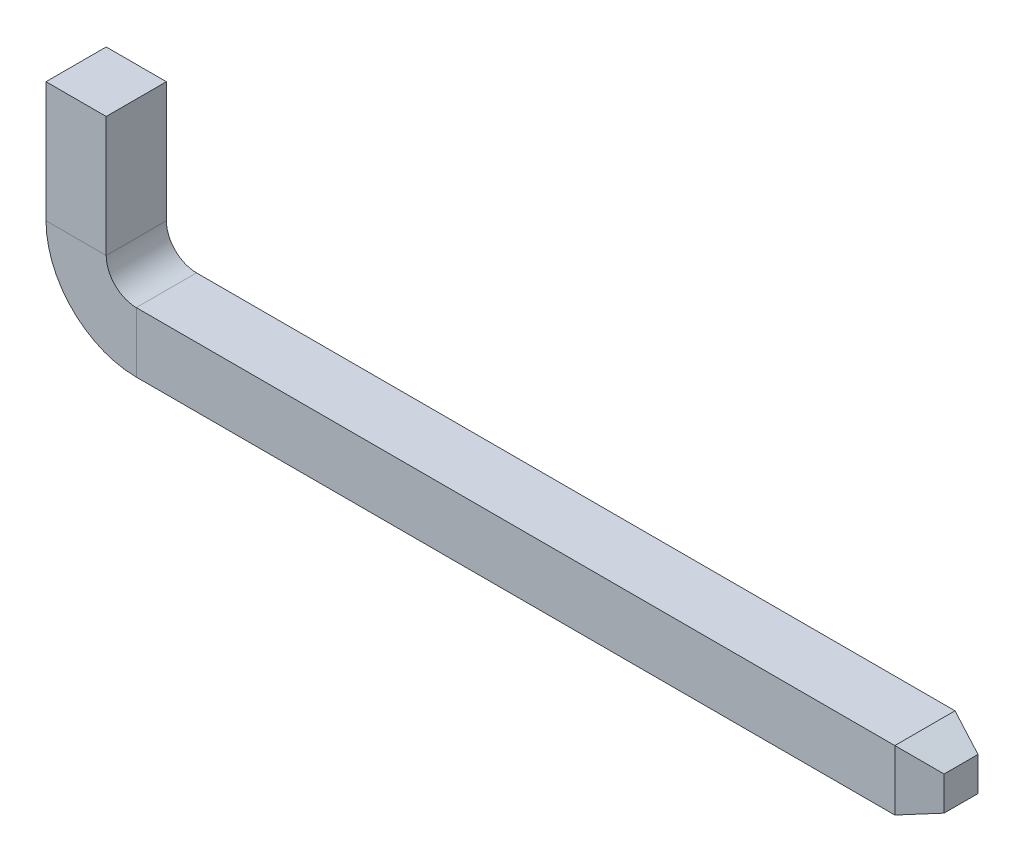
ISO-10303-21;
HEADER;
FILE_DESCRIPTION(('STEP AP214'),'2;1');
FILE_NAME('part.step','',(''),(''),'','','');
FILE_SCHEMA(('AUTOMOTIVE_DESIGN { 1 0 10303 214 1 1 1 1 }'));
ENDSEC;
DATA;
#1=APPLICATION_CONTEXT('core data for automotive mechanical design processes');
#2=APPLICATION_PROTOCOL_DEFINITION('international standard','automotive_design',2000,#1);
#3=PRODUCT_CONTEXT('',#1,'mechanical');
#4=PRODUCT('Part','Part','',(#3));
#5=PRODUCT_RELATED_PRODUCT_CATEGORY('part','',(#4));
#6=PRODUCT_DEFINITION_FORMATION('','',#4);
#7=PRODUCT_DEFINITION_CONTEXT('part definition',#1,'design');
#8=PRODUCT_DEFINITION('design','',#6,#7);
#9=PRODUCT_DEFINITION_SHAPE('','',#8);
#10=(LENGTH_UNIT() NAMED_UNIT(*) SI_UNIT(.MILLI.,.METRE.));
#11=(NAMED_UNIT(*) PLANE_ANGLE_UNIT() SI_UNIT($,.RADIAN.));
#12=(NAMED_UNIT(*) SI_UNIT($,.STERADIAN.) SOLID_ANGLE_UNIT());
#13=UNCERTAINTY_MEASURE_WITH_UNIT(LENGTH_MEASURE(1.E-05),#10,'distance_accuracy_value','');
#14=(GEOMETRIC_REPRESENTATION_CONTEXT(3) GLOBAL_UNCERTAINTY_ASSIGNED_CONTEXT((#13)) GLOBAL_UNIT_ASSIGNED_CONTEXT((#10,
#11,#12)) REPRESENTATION_CONTEXT('',''));
#15=CARTESIAN_POINT('',(0.,0.,0.));
#16=DIRECTION('',(0.,0.,1.));
#17=DIRECTION('',(1.,0.,0.));
#18=AXIS2_PLACEMENT_3D('',#15,#16,#17);
#19=CARTESIAN_POINT('',(0.,0.,0.));
#20=DIRECTION('',(0.,-1.,0.));
#21=DIRECTION('',(0.,0.,-1.));
#22=AXIS2_PLACEMENT_3D('',#19,#20,#21);
#23=PLANE('',#22);
#24=DIRECTION('',(0.,0.,-1.));
#25=VECTOR('',#24,1.);
#26=CARTESIAN_POINT('',(0.25,0.,0.25));
#27=LINE('',#26,#25);
#28=CARTESIAN_POINT('',(0.25,0.,0.25));
#29=VERTEX_POINT('',#28);
#30=CARTESIAN_POINT('',(0.25,0.,-0.25));
#31=VERTEX_POINT('',#30);
#32=EDGE_CURVE('E123',#29,#31,#27,.T.);
#33=ORIENTED_EDGE('',*,*,#32,.T.);
#34=DIRECTION('',(-1.,0.,0.));
#35=VECTOR('',#34,1.);
#36=CARTESIAN_POINT('',(-0.25,0.,-0.25));
#37=LINE('',#36,#35);
#38=CARTESIAN_POINT('',(-0.25,0.,-0.25));
#39=VERTEX_POINT('',#38);
#40=EDGE_CURVE('E151',#31,#39,#37,.T.);
#41=ORIENTED_EDGE('',*,*,#40,.T.);
#42=DIRECTION('',(0.,0.,1.));
#43=VECTOR('',#42,1.);
#44=CARTESIAN_POINT('',(-0.25,0.,0.25));
#45=LINE('',#44,#43);
#46=CARTESIAN_POINT('',(-0.25,0.,0.25));
#47=VERTEX_POINT('',#46);
#48=EDGE_CURVE('E154',#39,#47,#45,.T.);
#49=ORIENTED_EDGE('',*,*,#48,.T.);
#50=DIRECTION('',(1.,0.,0.));
#51=VECTOR('',#50,1.);
#52=CARTESIAN_POINT('',(-0.25,0.,0.25));
#53=LINE('',#52,#51);
#54=EDGE_CURVE('E171',#47,#29,#53,.T.);
#55=ORIENTED_EDGE('',*,*,#54,.T.);
#56=EDGE_LOOP('',(#33,#41,#49,#55));
#57=FACE_BOUND('',#56,.T.);
#58=ADVANCED_FACE('F32',(#57),#23,.F.);
#59=CARTESIAN_POINT('',(0.25,0.,0.25));
#60=DIRECTION('',(-1.,0.,0.));
#61=DIRECTION('',(0.,-1.,0.));
#62=AXIS2_PLACEMENT_3D('',#59,#60,#61);
#63=PLANE('',#62);
#64=DIRECTION('',(0.,-1.,0.));
#65=VECTOR('',#64,1.);
#66=CARTESIAN_POINT('',(0.25,0.,-0.25));
#67=LINE('',#66,#65);
#68=CARTESIAN_POINT('',(0.25,-1.,-0.25));
#69=VERTEX_POINT('',#68);
#70=EDGE_CURVE('E159',#31,#69,#67,.T.);
#71=ORIENTED_EDGE('',*,*,#70,.F.);
#72=ORIENTED_EDGE('',*,*,#32,.F.);
#73=DIRECTION('',(0.,-1.,0.));
#74=VECTOR('',#73,1.);
#75=CARTESIAN_POINT('',(0.25,0.,0.25));
#76=LINE('',#75,#74);
#77=CARTESIAN_POINT('',(0.25,-1.,0.25));
#78=VERTEX_POINT('',#77);
#79=EDGE_CURVE('E186',#29,#78,#76,.T.);
#80=ORIENTED_EDGE('',*,*,#79,.T.);
#81=DIRECTION('',(0.,0.,-1.));
#82=VECTOR('',#81,1.);
#83=CARTESIAN_POINT('',(0.25,-1.,0.25));
#84=LINE('',#83,#82);
#85=EDGE_CURVE('E202',#78,#69,#84,.T.);
#86=ORIENTED_EDGE('',*,*,#85,.T.);
#87=EDGE_LOOP('',(#71,#72,#80,#86));
#88=FACE_BOUND('',#87,.T.);
#89=ADVANCED_FACE('F271',(#88),#63,.F.);
#90=CARTESIAN_POINT('',(-0.25,0.,-0.25));
#91=DIRECTION('',(0.,0.,1.));
#92=DIRECTION('',(1.,0.,0.));
#93=AXIS2_PLACEMENT_3D('',#90,#91,#92);
#94=PLANE('',#93);
#95=DIRECTION('',(0.,-1.,0.));
#96=VECTOR('',#95,1.);
#97=CARTESIAN_POINT('',(-0.25,0.,-0.25));
#98=LINE('',#97,#96);
#99=CARTESIAN_POINT('',(-0.25,-1.,-0.25));
#100=VERTEX_POINT('',#99);
#101=EDGE_CURVE('E158',#39,#100,#98,.T.);
#102=ORIENTED_EDGE('',*,*,#101,.F.);
#103=ORIENTED_EDGE('',*,*,#40,.F.);
#104=ORIENTED_EDGE('',*,*,#70,.T.);
#105=DIRECTION('',(-1.,0.,0.));
#106=VECTOR('',#105,1.);
#107=CARTESIAN_POINT('',(-0.25,-1.,-0.25));
#108=LINE('',#107,#106);
#109=EDGE_CURVE('E155',#69,#100,#108,.T.);
#110=ORIENTED_EDGE('',*,*,#109,.T.);
#111=EDGE_LOOP('',(#102,#103,#104,#110));
#112=FACE_BOUND('',#111,.T.);
#113=ADVANCED_FACE('F263',(#112),#94,.F.);
#114=CARTESIAN_POINT('',(-0.25,0.,0.25));
#115=DIRECTION('',(1.,0.,0.));
#116=DIRECTION('',(0.,1.,0.));
#117=AXIS2_PLACEMENT_3D('',#114,#115,#116);
#118=PLANE('',#117);
#119=DIRECTION('',(0.,-1.,0.));
#120=VECTOR('',#119,1.);
#121=CARTESIAN_POINT('',(-0.25,0.,0.25));
#122=LINE('',#121,#120);
#123=CARTESIAN_POINT('',(-0.25,-1.,0.25));
#124=VERTEX_POINT('',#123);
#125=EDGE_CURVE('E174',#47,#124,#122,.T.);
#126=ORIENTED_EDGE('',*,*,#125,.F.);
#127=ORIENTED_EDGE('',*,*,#48,.F.);
#128=ORIENTED_EDGE('',*,*,#101,.T.);
#129=DIRECTION('',(0.,0.,1.));
#130=VECTOR('',#129,1.);
#131=CARTESIAN_POINT('',(-0.25,-1.,0.25));
#132=LINE('',#131,#130);
#133=EDGE_CURVE('E162',#100,#124,#132,.T.);
#134=ORIENTED_EDGE('',*,*,#133,.T.);
#135=EDGE_LOOP('',(#126,#127,#128,#134));
#136=FACE_BOUND('',#135,.T.);
#137=ADVANCED_FACE('F255',(#136),#118,.F.);
#138=CARTESIAN_POINT('',(-0.25,0.,0.25));
#139=DIRECTION('',(0.,0.,-1.));
#140=DIRECTION('',(-1.,0.,0.));
#141=AXIS2_PLACEMENT_3D('',#138,#139,#140);
#142=PLANE('',#141);
#143=DIRECTION('',(1.,0.,0.));
#144=VECTOR('',#143,1.);
#145=CARTESIAN_POINT('',(-0.25,-1.,0.25));
#146=LINE('',#145,#144);
#147=EDGE_CURVE('E177',#124,#78,#146,.T.);
#148=ORIENTED_EDGE('',*,*,#147,.T.);
#149=ORIENTED_EDGE('',*,*,#79,.F.);
#150=ORIENTED_EDGE('',*,*,#54,.F.);
#151=ORIENTED_EDGE('',*,*,#125,.T.);
#152=EDGE_LOOP('',(#148,#149,#150,#151));
#153=FACE_BOUND('',#152,.T.);
#154=ADVANCED_FACE('F253',(#153),#142,.F.);
#155=CARTESIAN_POINT('',(0.5,-1.,0.));
#156=DIRECTION('',(0.,0.,1.));
#157=DIRECTION('',(1.,0.,0.));
#158=AXIS2_PLACEMENT_3D('',#155,#156,#157);
#159=CYLINDRICAL_SURFACE('',#158,0.25);
#160=CARTESIAN_POINT('',(0.5,-1.,-0.25));
#161=DIRECTION('',(0.,0.,1.));
#162=DIRECTION('',(-1.,0.,0.));
#163=AXIS2_PLACEMENT_3D('',#160,#161,#162);
#164=CIRCLE('',#163,0.25);
#165=CARTESIAN_POINT('',(0.5,-1.25,-0.25));
#166=VERTEX_POINT('',#165);
#167=EDGE_CURVE('E164',#69,#166,#164,.T.);
#168=ORIENTED_EDGE('',*,*,#167,.F.);
#169=ORIENTED_EDGE('',*,*,#85,.F.);
#170=CARTESIAN_POINT('',(0.5,-1.,0.25));
#171=DIRECTION('',(0.,0.,1.));
#172=DIRECTION('',(-1.,0.,0.));
#173=AXIS2_PLACEMENT_3D('',#170,#171,#172);
#174=CIRCLE('',#173,0.25);
#175=CARTESIAN_POINT('',(0.5,-1.25,0.25));
#176=VERTEX_POINT('',#175);
#177=EDGE_CURVE('E188',#78,#176,#174,.T.);
#178=ORIENTED_EDGE('',*,*,#177,.T.);
#179=DIRECTION('',(0.,0.,-1.));
#180=VECTOR('',#179,1.);
#181=CARTESIAN_POINT('',(0.5,-1.25,0.25));
#182=LINE('',#181,#180);
#183=EDGE_CURVE('E196',#176,#166,#182,.T.);
#184=ORIENTED_EDGE('',*,*,#183,.T.);
#185=EDGE_LOOP('',(#168,#169,#178,#184));
#186=FACE_BOUND('',#185,.T.);
#187=ADVANCED_FACE('F200',(#186),#159,.F.);
#188=CARTESIAN_POINT('',(-0.25,-1.,-0.25));
#189=DIRECTION('',(0.,0.,1.));
#190=DIRECTION('',(1.,0.,0.));
#191=AXIS2_PLACEMENT_3D('',#188,#189,#190);
#192=PLANE('',#191);
#193=CARTESIAN_POINT('',(0.5,-1.,-0.25));
#194=DIRECTION('',(0.,0.,1.));
#195=DIRECTION('',(-1.,0.,0.));
#196=AXIS2_PLACEMENT_3D('',#193,#194,#195);
#197=CIRCLE('',#196,0.75);
#198=CARTESIAN_POINT('',(0.5,-1.75,-0.25));
#199=VERTEX_POINT('',#198);
#200=EDGE_CURVE('E77',#100,#199,#197,.T.);
#201=ORIENTED_EDGE('',*,*,#200,.F.);
#202=ORIENTED_EDGE('',*,*,#109,.F.);
#203=ORIENTED_EDGE('',*,*,#167,.T.);
#204=DIRECTION('',(0.,-1.,0.));
#205=VECTOR('',#204,1.);
#206=CARTESIAN_POINT('',(0.5,-1.75,-0.25));
#207=LINE('',#206,#205);
#208=EDGE_CURVE('E144',#166,#199,#207,.T.);
#209=ORIENTED_EDGE('',*,*,#208,.T.);
#210=EDGE_LOOP('',(#201,#202,#203,#209));
#211=FACE_BOUND('',#210,.T.);
#212=ADVANCED_FACE('F260',(#211),#192,.F.);
#213=CARTESIAN_POINT('',(0.5,-1.,0.));
#214=DIRECTION('',(0.,0.,1.));
#215=DIRECTION('',(1.,0.,0.));
#216=AXIS2_PLACEMENT_3D('',#213,#214,#215);
#217=CYLINDRICAL_SURFACE('',#216,0.75);
#218=CARTESIAN_POINT('',(0.5,-1.,0.25));
#219=DIRECTION('',(0.,0.,1.));
#220=DIRECTION('',(-1.,0.,0.));
#221=AXIS2_PLACEMENT_3D('',#218,#219,#220);
#222=CIRCLE('',#221,0.75);
#223=CARTESIAN_POINT('',(0.5,-1.75,0.25));
#224=VERTEX_POINT('',#223);
#225=EDGE_CURVE('E66',#124,#224,#222,.T.);
#226=ORIENTED_EDGE('',*,*,#225,.F.);
#227=ORIENTED_EDGE('',*,*,#133,.F.);
#228=ORIENTED_EDGE('',*,*,#200,.T.);
#229=DIRECTION('',(0.,0.,1.));
#230=VECTOR('',#229,1.);
#231=CARTESIAN_POINT('',(0.5,-1.75,0.25));
#232=LINE('',#231,#230);
#233=EDGE_CURVE('E165',#199,#224,#232,.T.);
#234=ORIENTED_EDGE('',*,*,#233,.T.);
#235=EDGE_LOOP('',(#226,#227,#228,#234));
#236=FACE_BOUND('',#235,.T.);
#237=ADVANCED_FACE('F252',(#236),#217,.T.);
#238=CARTESIAN_POINT('',(-0.25,-1.,0.25));
#239=DIRECTION('',(0.,0.,-1.));
#240=DIRECTION('',(-1.,0.,0.));
#241=AXIS2_PLACEMENT_3D('',#238,#239,#240);
#242=PLANE('',#241);
#243=DIRECTION('',(0.,1.,0.));
#244=VECTOR('',#243,1.);
#245=CARTESIAN_POINT('',(0.5,-1.75,0.25));
#246=LINE('',#245,#244);
#247=EDGE_CURVE('E150',#224,#176,#246,.T.);
#248=ORIENTED_EDGE('',*,*,#247,.T.);
#249=ORIENTED_EDGE('',*,*,#177,.F.);
#250=ORIENTED_EDGE('',*,*,#147,.F.);
#251=ORIENTED_EDGE('',*,*,#225,.T.);
#252=EDGE_LOOP('',(#248,#249,#250,#251));
#253=FACE_BOUND('',#252,.T.);
#254=ADVANCED_FACE('F192',(#253),#242,.F.);
#255=CARTESIAN_POINT('',(0.5,-1.25,0.25));
#256=DIRECTION('',(0.,-1.,0.));
#257=DIRECTION('',(0.,0.,-1.));
#258=AXIS2_PLACEMENT_3D('',#255,#256,#257);
#259=PLANE('',#258);
#260=DIRECTION('',(1.,0.,0.));
#261=VECTOR('',#260,1.);
#262=CARTESIAN_POINT('',(0.5,-1.25,-0.25));
#263=LINE('',#262,#261);
#264=CARTESIAN_POINT('',(6.8,-1.25,-0.25));
#265=VERTEX_POINT('',#264);
#266=EDGE_CURVE('E134',#166,#265,#263,.T.);
#267=ORIENTED_EDGE('',*,*,#266,.F.);
#268=ORIENTED_EDGE('',*,*,#183,.F.);
#269=DIRECTION('',(1.,0.,0.));
#270=VECTOR('',#269,1.);
#271=CARTESIAN_POINT('',(0.5,-1.25,0.25));
#272=LINE('',#271,#270);
#273=CARTESIAN_POINT('',(6.8,-1.25,0.25));
#274=VERTEX_POINT('',#273);
#275=EDGE_CURVE('E141',#176,#274,#272,.T.);
#276=ORIENTED_EDGE('',*,*,#275,.T.);
#277=DIRECTION('',(0.,0.,-1.));
#278=VECTOR('',#277,1.);
#279=CARTESIAN_POINT('',(6.8,-1.25,0.25));
#280=LINE('',#279,#278);
#281=EDGE_CURVE('E119',#274,#265,#280,.T.);
#282=ORIENTED_EDGE('',*,*,#281,.T.);
#283=EDGE_LOOP('',(#267,#268,#276,#282));
#284=FACE_BOUND('',#283,.T.);
#285=ADVANCED_FACE('F138',(#284),#259,.F.);
#286=CARTESIAN_POINT('',(0.5,-1.75,-0.25));
#287=DIRECTION('',(0.,0.,1.));
#288=DIRECTION('',(1.,0.,0.));
#289=AXIS2_PLACEMENT_3D('',#286,#287,#288);
#290=PLANE('',#289);
#291=DIRECTION('',(1.,0.,0.));
#292=VECTOR('',#291,1.);
#293=CARTESIAN_POINT('',(0.5,-1.75,-0.25));
#294=LINE('',#293,#292);
#295=CARTESIAN_POINT('',(6.8,-1.75,-0.25));
#296=VERTEX_POINT('',#295);
#297=EDGE_CURVE('E133',#199,#296,#294,.T.);
#298=ORIENTED_EDGE('',*,*,#297,.F.);
#299=ORIENTED_EDGE('',*,*,#208,.F.);
#300=ORIENTED_EDGE('',*,*,#266,.T.);
#301=DIRECTION('',(0.,-1.,0.));
#302=VECTOR('',#301,1.);
#303=CARTESIAN_POINT('',(6.8,-1.75,-0.25));
#304=LINE('',#303,#302);
#305=EDGE_CURVE('E127',#265,#296,#304,.T.);
#306=ORIENTED_EDGE('',*,*,#305,.T.);
#307=EDGE_LOOP('',(#298,#299,#300,#306));
#308=FACE_BOUND('',#307,.T.);
#309=ADVANCED_FACE('F143',(#308),#290,.F.);
#310=CARTESIAN_POINT('',(0.5,-1.75,0.25));
#311=DIRECTION('',(0.,1.,0.));
#312=DIRECTION('',(0.,0.,1.));
#313=AXIS2_PLACEMENT_3D('',#310,#311,#312);
#314=PLANE('',#313);
#315=DIRECTION('',(1.,0.,0.));
#316=VECTOR('',#315,1.);
#317=CARTESIAN_POINT('',(0.5,-1.75,0.25));
#318=LINE('',#317,#316);
#319=CARTESIAN_POINT('',(6.8,-1.75,0.25));
#320=VERTEX_POINT('',#319);
#321=EDGE_CURVE('E40',#224,#320,#318,.T.);
#322=ORIENTED_EDGE('',*,*,#321,.F.);
#323=ORIENTED_EDGE('',*,*,#233,.F.);
#324=ORIENTED_EDGE('',*,*,#297,.T.);
#325=DIRECTION('',(0.,0.,1.));
#326=VECTOR('',#325,1.);
#327=CARTESIAN_POINT('',(6.8,-1.75,0.25));
#328=LINE('',#327,#326);
#329=EDGE_CURVE('E168',#296,#320,#328,.T.);
#330=ORIENTED_EDGE('',*,*,#329,.T.);
#331=EDGE_LOOP('',(#322,#323,#324,#330));
#332=FACE_BOUND('',#331,.T.);
#333=ADVANCED_FACE('F230',(#332),#314,.F.);
#334=CARTESIAN_POINT('',(0.5,-1.75,0.25));
#335=DIRECTION('',(0.,0.,-1.));
#336=DIRECTION('',(-1.,0.,0.));
#337=AXIS2_PLACEMENT_3D('',#334,#335,#336);
#338=PLANE('',#337);
#339=DIRECTION('',(0.,1.,0.));
#340=VECTOR('',#339,1.);
#341=CARTESIAN_POINT('',(6.8,-1.75,0.25));
#342=LINE('',#341,#340);
#343=EDGE_CURVE('E11',#320,#274,#342,.T.);
#344=ORIENTED_EDGE('',*,*,#343,.T.);
#345=ORIENTED_EDGE('',*,*,#275,.F.);
#346=ORIENTED_EDGE('',*,*,#247,.F.);
#347=ORIENTED_EDGE('',*,*,#321,.T.);
#348=EDGE_LOOP('',(#344,#345,#346,#347));
#349=FACE_BOUND('',#348,.T.);
#350=ADVANCED_FACE('F232',(#349),#338,.F.);
#351=CARTESIAN_POINT('',(6.8,-1.75,-0.25));
#352=DIRECTION('',(0.342020143325669,0.,-0.939692620785908));
#353=DIRECTION('',(-0.939692620785908,0.,-0.342020143325669));
#354=AXIS2_PLACEMENT_3D('',#351,#352,#353);
#355=PLANE('',#354);
#356=ORIENTED_EDGE('',*,*,#305,.F.);
#357=DIRECTION('',(-0.889126490715988,0.323615577118185,-0.323615577118185));
#358=VECTOR('',#357,1.);
#359=CARTESIAN_POINT('',(6.8,-1.25,-0.25));
#360=LINE('',#359,#358);
#361=CARTESIAN_POINT('',(7.1,-1.35919107027986,-0.140808929720139));
#362=VERTEX_POINT('',#361);
#363=EDGE_CURVE('E115',#362,#265,#360,.T.);
#364=ORIENTED_EDGE('',*,*,#363,.F.);
#365=DIRECTION('',(0.,-1.,0.));
#366=VECTOR('',#365,1.);
#367=CARTESIAN_POINT('',(7.1,-1.75,-0.140808929720139));
#368=LINE('',#367,#366);
#369=CARTESIAN_POINT('',(7.1,-1.64080892972014,-0.140808929720139));
#370=VERTEX_POINT('',#369);
#371=EDGE_CURVE('E217',#370,#362,#368,.F.);
#372=ORIENTED_EDGE('',*,*,#371,.F.);
#373=DIRECTION('',(-0.889126490715988,-0.323615577118185,-0.323615577118185));
#374=VECTOR('',#373,1.);
#375=CARTESIAN_POINT('',(6.8,-1.75,-0.25));
#376=LINE('',#375,#374);
#377=EDGE_CURVE('E47',#370,#296,#376,.T.);
#378=ORIENTED_EDGE('',*,*,#377,.T.);
#379=EDGE_LOOP('',(#356,#364,#372,#378));
#380=FACE_BOUND('',#379,.T.);
#381=ADVANCED_FACE('F128',(#380),#355,.T.);
#382=CARTESIAN_POINT('',(6.8,-1.25,-0.25));
#383=DIRECTION('',(0.342020143325669,0.939692620785908,0.));
#384=DIRECTION('',(-0.939692620785908,0.342020143325669,0.));
#385=AXIS2_PLACEMENT_3D('',#382,#383,#384);
#386=PLANE('',#385);
#387=ORIENTED_EDGE('',*,*,#281,.F.);
#388=DIRECTION('',(-0.889126490715988,0.323615577118185,0.323615577118185));
#389=VECTOR('',#388,1.);
#390=CARTESIAN_POINT('',(6.8,-1.25,0.25));
#391=LINE('',#390,#389);
#392=CARTESIAN_POINT('',(7.1,-1.35919107027986,0.140808929720139));
#393=VERTEX_POINT('',#392);
#394=EDGE_CURVE('E124',#393,#274,#391,.T.);
#395=ORIENTED_EDGE('',*,*,#394,.F.);
#396=DIRECTION('',(0.,0.,-1.));
#397=VECTOR('',#396,1.);
#398=CARTESIAN_POINT('',(7.1,-1.35919107027986,-0.25));
#399=LINE('',#398,#397);
#400=EDGE_CURVE('E121',#362,#393,#399,.F.);
#401=ORIENTED_EDGE('',*,*,#400,.F.);
#402=ORIENTED_EDGE('',*,*,#363,.T.);
#403=EDGE_LOOP('',(#387,#395,#401,#402));
#404=FACE_BOUND('',#403,.T.);
#405=ADVANCED_FACE('F116',(#404),#386,.T.);
#406=CARTESIAN_POINT('',(6.8,-1.25,0.25));
#407=DIRECTION('',(0.342020143325669,0.,0.939692620785908));
#408=DIRECTION('',(0.939692620785908,0.,-0.342020143325669));
#409=AXIS2_PLACEMENT_3D('',#406,#407,#408);
#410=PLANE('',#409);
#411=ORIENTED_EDGE('',*,*,#343,.F.);
#412=DIRECTION('',(-0.889126490715988,-0.323615577118185,0.323615577118185));
#413=VECTOR('',#412,1.);
#414=CARTESIAN_POINT('',(6.8,-1.75,0.25));
#415=LINE('',#414,#413);
#416=CARTESIAN_POINT('',(7.1,-1.64080892972014,0.140808929720139));
#417=VERTEX_POINT('',#416);
#418=EDGE_CURVE('E220',#417,#320,#415,.T.);
#419=ORIENTED_EDGE('',*,*,#418,.F.);
#420=DIRECTION('',(0.,1.,0.));
#421=VECTOR('',#420,1.);
#422=CARTESIAN_POINT('',(7.1,-1.25,0.140808929720139));
#423=LINE('',#422,#421);
#424=EDGE_CURVE('E214',#393,#417,#423,.F.);
#425=ORIENTED_EDGE('',*,*,#424,.F.);
#426=ORIENTED_EDGE('',*,*,#394,.T.);
#427=EDGE_LOOP('',(#411,#419,#425,#426));
#428=FACE_BOUND('',#427,.T.);
#429=ADVANCED_FACE('F233',(#428),#410,.T.);
#430=CARTESIAN_POINT('',(6.8,-1.75,0.25));
#431=DIRECTION('',(0.342020143325669,-0.939692620785908,0.));
#432=DIRECTION('',(0.939692620785908,0.342020143325669,0.));
#433=AXIS2_PLACEMENT_3D('',#430,#431,#432);
#434=PLANE('',#433);
#435=ORIENTED_EDGE('',*,*,#329,.F.);
#436=ORIENTED_EDGE('',*,*,#377,.F.);
#437=DIRECTION('',(0.,0.,1.));
#438=VECTOR('',#437,1.);
#439=CARTESIAN_POINT('',(7.1,-1.64080892972014,0.25));
#440=LINE('',#439,#438);
#441=EDGE_CURVE('E212',#417,#370,#440,.F.);
#442=ORIENTED_EDGE('',*,*,#441,.F.);
#443=ORIENTED_EDGE('',*,*,#418,.T.);
#444=EDGE_LOOP('',(#435,#436,#442,#443));
#445=FACE_BOUND('',#444,.T.);
#446=ADVANCED_FACE('F226',(#445),#434,.T.);
#447=CARTESIAN_POINT('',(7.1,0.,0.));
#448=DIRECTION('',(1.,0.,0.));
#449=DIRECTION('',(0.,0.,-1.));
#450=AXIS2_PLACEMENT_3D('',#447,#448,#449);
#451=PLANE('',#450);
#452=ORIENTED_EDGE('',*,*,#371,.T.);
#453=ORIENTED_EDGE('',*,*,#400,.T.);
#454=ORIENTED_EDGE('',*,*,#424,.T.);
#455=ORIENTED_EDGE('',*,*,#441,.T.);
#456=EDGE_LOOP('',(#452,#453,#454,#455));
#457=FACE_BOUND('',#456,.T.);
#458=ADVANCED_FACE('F235',(#457),#451,.T.);
#459=CLOSED_SHELL('',(#58,#89,#113,#137,#154,#187,#212,#237,#254,#285,#309,#333,#350,#381,#405,
#429,#446,#458));
#460=MANIFOLD_SOLID_BREP('B2',#459);
#461=ADVANCED_BREP_SHAPE_REPRESENTATION('',(#18,#460),#14);
#462=SHAPE_DEFINITION_REPRESENTATION(#9,#461);
ENDSEC;
END-ISO-10303-21;
